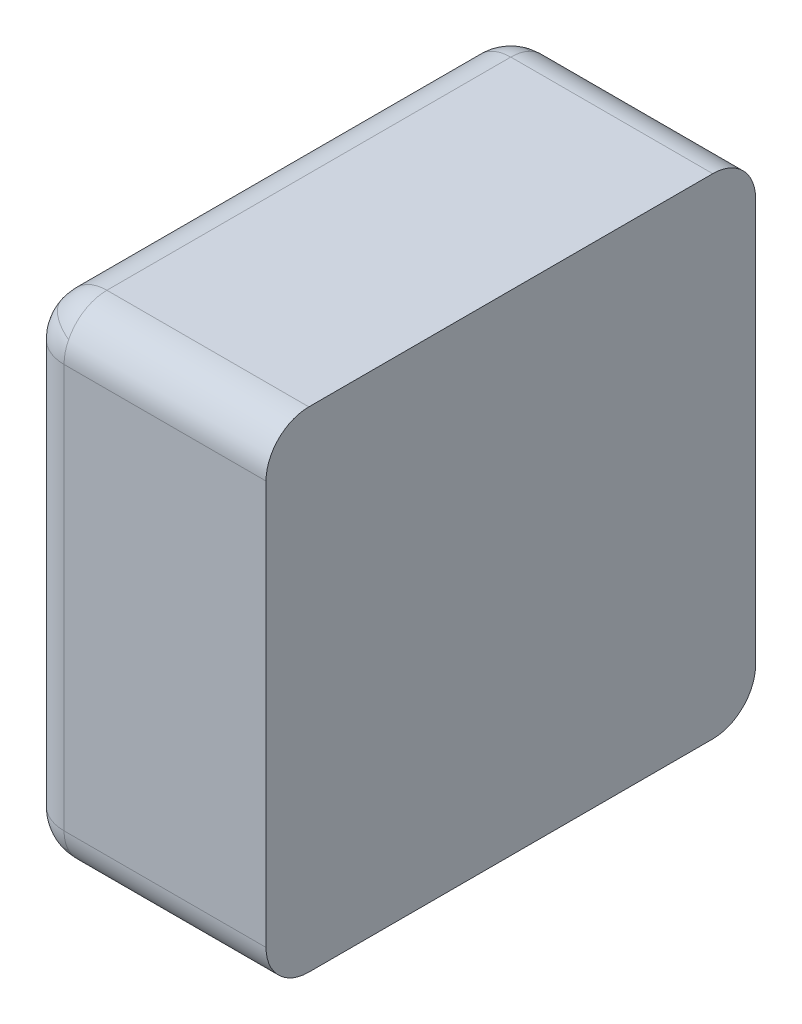
ISO-10303-21;
HEADER;
FILE_DESCRIPTION(('STEP AP214'),'2;1');
FILE_NAME('part.step','',(''),(''),'','','');
FILE_SCHEMA(('AUTOMOTIVE_DESIGN { 1 0 10303 214 1 1 1 1 }'));
ENDSEC;
DATA;
#1=APPLICATION_CONTEXT('core data for automotive mechanical design processes');
#2=APPLICATION_PROTOCOL_DEFINITION('international standard','automotive_design',2000,#1);
#3=PRODUCT_CONTEXT('',#1,'mechanical');
#4=PRODUCT('Part','Part','',(#3));
#5=PRODUCT_RELATED_PRODUCT_CATEGORY('part','',(#4));
#6=PRODUCT_DEFINITION_FORMATION('','',#4);
#7=PRODUCT_DEFINITION_CONTEXT('part definition',#1,'design');
#8=PRODUCT_DEFINITION('design','',#6,#7);
#9=PRODUCT_DEFINITION_SHAPE('','',#8);
#10=(LENGTH_UNIT() NAMED_UNIT(*) SI_UNIT(.MILLI.,.METRE.));
#11=(NAMED_UNIT(*) PLANE_ANGLE_UNIT() SI_UNIT($,.RADIAN.));
#12=(NAMED_UNIT(*) SI_UNIT($,.STERADIAN.) SOLID_ANGLE_UNIT());
#13=UNCERTAINTY_MEASURE_WITH_UNIT(LENGTH_MEASURE(1.E-05),#10,'distance_accuracy_value','');
#14=(GEOMETRIC_REPRESENTATION_CONTEXT(3) GLOBAL_UNCERTAINTY_ASSIGNED_CONTEXT((#13)) GLOBAL_UNIT_ASSIGNED_CONTEXT((#10,
#11,#12)) REPRESENTATION_CONTEXT('',''));
#15=CARTESIAN_POINT('',(0.,0.,0.));
#16=DIRECTION('',(0.,0.,1.));
#17=DIRECTION('',(1.,0.,0.));
#18=AXIS2_PLACEMENT_3D('',#15,#16,#17);
#19=CARTESIAN_POINT('',(-0.770414518843274,-0.370414518843274,0.0295854811567261));
#20=CARTESIAN_POINT('',(-0.770414518843274,-0.370414518843274,0.029585481156726));
#21=CARTESIAN_POINT('',(-0.770414518843274,-0.370414518843274,0.0295854811567259));
#22=CARTESIAN_POINT('',(-0.770414518843274,-0.370414518843274,0.0295854811567262));
#23=CARTESIAN_POINT('',(-0.786913435216178,-0.370414518843274,0.0460843975296307));
#24=CARTESIAN_POINT('',(-0.805964742834645,-0.332311903606339,0.0270330899111633));
#25=CARTESIAN_POINT('',(-0.772966910088836,-0.332311903606339,-0.00596474283464589));
#26=CARTESIAN_POINT('',(-0.753915602470369,-0.370414518843274,0.0130865647838215));
#27=CARTESIAN_POINT('',(-0.795316860626127,-0.364187485463226,0.0669418896996738));
#28=CARTESIAN_POINT('',(-0.831261966886138,-0.292297272943205,0.0309967834396627));
#29=CARTESIAN_POINT('',(-0.769003216560336,-0.292297272943205,-0.0312619668861383));
#30=CARTESIAN_POINT('',(-0.733058110300326,-0.364187485463227,0.00468313937387291));
#31=CARTESIAN_POINT('',(-0.793721464748298,-0.353143808025074,0.0874338486981503));
#32=CARTESIAN_POINT('',(-0.840576506812773,-0.259433723896123,0.040578806633675));
#33=CARTESIAN_POINT('',(-0.759421193366325,-0.259433723896124,-0.0405765068127728));
#34=CARTESIAN_POINT('',(-0.71256615130185,-0.353143808025074,0.00627853525170252));
#35=(BOUNDED_SURFACE() B_SPLINE_SURFACE(3,3,((#19,#20,#21,#22),(#23,#24,#25,#26),(#27,#28,#29,
#30),(#31,#32,#33,#34)),.UNSPECIFIED.,.F.,.F.,.F.) B_SPLINE_SURFACE_WITH_KNOTS((4,4),(4,4),(0.,
1.),(0.,1.),.UNSPECIFIED.) GEOMETRIC_REPRESENTATION_ITEM() RATIONAL_B_SPLINE_SURFACE(((1.,
0.333333333333333,0.333333333333333,1.),(0.924501806030637,0.308167268676879,0.308167268676879,
0.924501806030637),(0.924501806030637,0.308167268676879,0.308167268676879,0.924501806030637),
(1.,0.333333333333333,0.333333333333333,1.))) REPRESENTATION_ITEM('') SURFACE());
#36=CARTESIAN_POINT('',(-0.73,-0.33,0.07));
#37=DIRECTION('',(0.408248290463862,-0.816496580927726,0.408248290463864));
#38=DIRECTION('',(-0.577350269189624,-0.577350269189626,-0.577350269189627));
#39=AXIS2_PLACEMENT_3D('',#36,#37,#38);
#40=CIRCLE('',#39,0.07);
#41=CARTESIAN_POINT('',(-0.770414518843274,-0.370414518843274,0.0295854811567261));
#42=VERTEX_POINT('',#41);
#43=CARTESIAN_POINT('',(-0.73,-0.361304951684997,0.00739009663000593));
#44=VERTEX_POINT('',#43);
#45=EDGE_CURVE('E11',#42,#44,#40,.T.);
#46=CARTESIAN_POINT('',(-0.73,-0.33,0.07));
#47=DIRECTION('',(-0.408248290463862,0.816496580927726,-0.408248290463864));
#48=DIRECTION('',(-0.577350269189625,-0.577350269189626,-0.577350269189626));
#49=AXIS2_PLACEMENT_3D('',#46,#47,#48);
#50=CIRCLE('',#49,0.07);
#51=CARTESIAN_POINT('',(-0.792609903369994,-0.361304951684997,0.07));
#52=VERTEX_POINT('',#51);
#53=EDGE_CURVE('E26',#42,#52,#50,.T.);
#54=CARTESIAN_POINT('',(-0.73,-0.33,0.07));
#55=DIRECTION('',(0.,0.,-1.));
#56=DIRECTION('',(1.,0.,0.));
#57=AXIS2_PLACEMENT_3D('',#54,#55,#56);
#58=CIRCLE('',#57,0.07);
#59=CARTESIAN_POINT('',(-0.8,-0.33,0.07));
#60=VERTEX_POINT('',#59);
#61=EDGE_CURVE('E274',#52,#60,#58,.T.);
#62=CARTESIAN_POINT('',(-0.73,-0.33,0.07));
#63=DIRECTION('',(0.,1.,0.));
#64=DIRECTION('',(1.,0.,0.));
#65=AXIS2_PLACEMENT_3D('',#62,#63,#64);
#66=CIRCLE('',#65,0.07);
#67=CARTESIAN_POINT('',(-0.73,-0.33,0.));
#68=VERTEX_POINT('',#67);
#69=EDGE_CURVE('E271',#68,#60,#66,.T.);
#70=CARTESIAN_POINT('',(-0.73,-0.33,0.07));
#71=DIRECTION('',(1.,0.,0.));
#72=DIRECTION('',(0.,0.,-1.));
#73=AXIS2_PLACEMENT_3D('',#70,#71,#72);
#74=CIRCLE('',#73,0.07);
#75=EDGE_CURVE('E268',#44,#68,#74,.T.);
#76=ORIENTED_EDGE('',*,*,#45,.F.);
#77=ORIENTED_EDGE('',*,*,#53,.T.);
#78=ORIENTED_EDGE('',*,*,#61,.T.);
#79=ORIENTED_EDGE('',*,*,#69,.F.);
#80=ORIENTED_EDGE('',*,*,#75,.F.);
#81=EDGE_LOOP('',(#76,#77,#78,#79,#80));
#82=FACE_BOUND('',#81,.T.);
#83=ADVANCED_FACE('F17',(#82),#35,.T.);
#84=CARTESIAN_POINT('',(-0.770414518843274,-0.370414518843274,0.770414518843274));
#85=CARTESIAN_POINT('',(-0.770414518843273,-0.370414518843274,0.770414518843274));
#86=CARTESIAN_POINT('',(-0.770414518843274,-0.370414518843273,0.770414518843274));
#87=CARTESIAN_POINT('',(-0.770414518843274,-0.370414518843274,0.770414518843274));
#88=CARTESIAN_POINT('',(-0.753915602470369,-0.370414518843274,0.786913435216178));
#89=CARTESIAN_POINT('',(-0.772966910088836,-0.332311903606339,0.805964742834646));
#90=CARTESIAN_POINT('',(-0.805964742834646,-0.332311903606339,0.772966910088837));
#91=CARTESIAN_POINT('',(-0.786913435216179,-0.370414518843274,0.753915602470369));
#92=CARTESIAN_POINT('',(-0.733058110300326,-0.364187485463227,0.795316860626127));
#93=CARTESIAN_POINT('',(-0.769003216560336,-0.292297272943205,0.831261966886138));
#94=CARTESIAN_POINT('',(-0.831261966886138,-0.292297272943204,0.769003216560338));
#95=CARTESIAN_POINT('',(-0.795316860626127,-0.364187485463227,0.733058110300326));
#96=CARTESIAN_POINT('',(-0.712566151301849,-0.353143808025074,0.793721464748297));
#97=CARTESIAN_POINT('',(-0.759421193366324,-0.259433723896123,0.840576506812773));
#98=CARTESIAN_POINT('',(-0.840576506812773,-0.259433723896122,0.759421193366326));
#99=CARTESIAN_POINT('',(-0.793721464748298,-0.353143808025074,0.71256615130185));
#100=(BOUNDED_SURFACE() B_SPLINE_SURFACE(3,3,((#84,#85,#86,#87),(#88,#89,#90,#91),(#92,#93,#94,
#95),(#96,#97,#98,#99)),.UNSPECIFIED.,.F.,.F.,.F.) B_SPLINE_SURFACE_WITH_KNOTS((4,4),(4,4),(0.,
1.),(0.,1.),.UNSPECIFIED.) GEOMETRIC_REPRESENTATION_ITEM() RATIONAL_B_SPLINE_SURFACE(((1.,
0.333333333333332,0.333333333333332,1.),(0.924501806030637,0.308167268676878,0.308167268676878,
0.924501806030637),(0.924501806030637,0.308167268676878,0.308167268676878,0.924501806030637),
(1.,0.333333333333332,0.333333333333332,1.))) REPRESENTATION_ITEM('') SURFACE());
#101=CARTESIAN_POINT('',(-0.73,-0.33,0.73));
#102=DIRECTION('',(0.408248290463862,-0.816496580927726,-0.408248290463864));
#103=DIRECTION('',(-0.577350269189624,-0.577350269189626,0.577350269189628));
#104=AXIS2_PLACEMENT_3D('',#101,#102,#103);
#105=CIRCLE('',#104,0.07);
#106=CARTESIAN_POINT('',(-0.770414518843274,-0.370414518843274,0.770414518843274));
#107=VERTEX_POINT('',#106);
#108=CARTESIAN_POINT('',(-0.792609903369994,-0.361304951684997,0.73));
#109=VERTEX_POINT('',#108);
#110=EDGE_CURVE('E266',#107,#109,#105,.T.);
#111=CARTESIAN_POINT('',(-0.73,-0.33,0.73));
#112=DIRECTION('',(-0.408248290463862,0.816496580927726,0.408248290463864));
#113=DIRECTION('',(-0.577350269189625,-0.577350269189626,0.577350269189627));
#114=AXIS2_PLACEMENT_3D('',#111,#112,#113);
#115=CIRCLE('',#114,0.07);
#116=CARTESIAN_POINT('',(-0.73,-0.361304951684997,0.792609903369994));
#117=VERTEX_POINT('',#116);
#118=EDGE_CURVE('E264',#107,#117,#115,.T.);
#119=CARTESIAN_POINT('',(-0.73,-0.33,0.73));
#120=DIRECTION('',(1.,0.,0.));
#121=DIRECTION('',(0.,0.,-1.));
#122=AXIS2_PLACEMENT_3D('',#119,#120,#121);
#123=CIRCLE('',#122,0.07);
#124=CARTESIAN_POINT('',(-0.73,-0.33,0.8));
#125=VERTEX_POINT('',#124);
#126=EDGE_CURVE('E261',#125,#117,#123,.T.);
#127=CARTESIAN_POINT('',(-0.73,-0.33,0.73));
#128=DIRECTION('',(0.,-1.,0.));
#129=DIRECTION('',(1.,0.,0.));
#130=AXIS2_PLACEMENT_3D('',#127,#128,#129);
#131=CIRCLE('',#130,0.07);
#132=CARTESIAN_POINT('',(-0.8,-0.33,0.73));
#133=VERTEX_POINT('',#132);
#134=EDGE_CURVE('E259',#125,#133,#131,.T.);
#135=CARTESIAN_POINT('',(-0.73,-0.33,0.73));
#136=DIRECTION('',(0.,0.,-1.));
#137=DIRECTION('',(1.,0.,0.));
#138=AXIS2_PLACEMENT_3D('',#135,#136,#137);
#139=CIRCLE('',#138,0.07);
#140=EDGE_CURVE('E256',#109,#133,#139,.T.);
#141=ORIENTED_EDGE('',*,*,#110,.F.);
#142=ORIENTED_EDGE('',*,*,#118,.T.);
#143=ORIENTED_EDGE('',*,*,#126,.F.);
#144=ORIENTED_EDGE('',*,*,#134,.T.);
#145=ORIENTED_EDGE('',*,*,#140,.F.);
#146=EDGE_LOOP('',(#141,#142,#143,#144,#145));
#147=FACE_BOUND('',#146,.T.);
#148=ADVANCED_FACE('F298',(#147),#100,.T.);
#149=CARTESIAN_POINT('',(-0.770414518843274,0.370414518843274,0.770414518843274));
#150=CARTESIAN_POINT('',(-0.770414518843274,0.370414518843274,0.770414518843274));
#151=CARTESIAN_POINT('',(-0.770414518843275,0.370414518843274,0.770414518843274));
#152=CARTESIAN_POINT('',(-0.770414518843274,0.370414518843274,0.770414518843274));
#153=CARTESIAN_POINT('',(-0.753915602470369,0.370414518843274,0.786913435216179));
#154=CARTESIAN_POINT('',(-0.734864294851902,0.408517134080209,0.767862127597712));
#155=CARTESIAN_POINT('',(-0.767862127597712,0.408517134080209,0.734864294851902));
#156=CARTESIAN_POINT('',(-0.786913435216179,0.370414518843274,0.753915602470369));
#157=CARTESIAN_POINT('',(-0.733058110300326,0.364187485463227,0.795316860626128));
#158=CARTESIAN_POINT('',(-0.697113004040315,0.436077697983249,0.759371754366117));
#159=CARTESIAN_POINT('',(-0.759371754366117,0.436077697983249,0.697113004040315));
#160=CARTESIAN_POINT('',(-0.795316860626128,0.364187485463226,0.733058110300326));
#161=CARTESIAN_POINT('',(-0.712566151301849,0.353143808025074,0.793721464748298));
#162=CARTESIAN_POINT('',(-0.665711109237374,0.446853892154025,0.746866422683823));
#163=CARTESIAN_POINT('',(-0.746866422683823,0.446853892154025,0.665711109237374));
#164=CARTESIAN_POINT('',(-0.793721464748298,0.353143808025074,0.712566151301849));
#165=(BOUNDED_SURFACE() B_SPLINE_SURFACE(3,3,((#149,#150,#151,#152),(#153,#154,#155,#156),(#157,
#158,#159,#160),(#161,#162,#163,#164)),.UNSPECIFIED.,.F.,.F.,
.F.) B_SPLINE_SURFACE_WITH_KNOTS((4,4),(4,4),(0.,1.),(0.,1.),
.UNSPECIFIED.) GEOMETRIC_REPRESENTATION_ITEM() RATIONAL_B_SPLINE_SURFACE(((1.,0.333333333333333,
0.333333333333333,1.),(0.924501806030636,0.308167268676879,0.308167268676879,0.924501806030636),
(0.924501806030636,0.308167268676879,0.308167268676879,0.924501806030636),(1.,0.333333333333333,
0.333333333333333,1.))) REPRESENTATION_ITEM('') SURFACE());
#166=CARTESIAN_POINT('',(-0.73,0.33,0.73));
#167=DIRECTION('',(-0.408248290463862,-0.816496580927727,0.408248290463862));
#168=DIRECTION('',(-0.577350269189627,0.577350269189624,0.577350269189627));
#169=AXIS2_PLACEMENT_3D('',#166,#167,#168);
#170=CIRCLE('',#169,0.07);
#171=CARTESIAN_POINT('',(-0.770414518843274,0.370414518843274,0.770414518843274));
#172=VERTEX_POINT('',#171);
#173=CARTESIAN_POINT('',(-0.792609903369994,0.361304951684997,0.73));
#174=VERTEX_POINT('',#173);
#175=EDGE_CURVE('E153',#172,#174,#170,.T.);
#176=CARTESIAN_POINT('',(-0.73,0.33,0.73));
#177=DIRECTION('',(0.408248290463861,0.816496580927728,-0.408248290463861));
#178=DIRECTION('',(-0.577350269189627,0.577350269189623,0.577350269189627));
#179=AXIS2_PLACEMENT_3D('',#176,#177,#178);
#180=CIRCLE('',#179,0.0700000000000001);
#181=CARTESIAN_POINT('',(-0.73,0.361304951684997,0.792609903369994));
#182=VERTEX_POINT('',#181);
#183=EDGE_CURVE('E253',#172,#182,#180,.T.);
#184=CARTESIAN_POINT('',(-0.73,0.33,0.73));
#185=DIRECTION('',(1.,0.,0.));
#186=DIRECTION('',(0.,-1.,0.));
#187=AXIS2_PLACEMENT_3D('',#184,#185,#186);
#188=CIRCLE('',#187,0.07);
#189=CARTESIAN_POINT('',(-0.73,0.4,0.73));
#190=VERTEX_POINT('',#189);
#191=EDGE_CURVE('E250',#190,#182,#188,.T.);
#192=CARTESIAN_POINT('',(-0.73,0.33,0.73));
#193=DIRECTION('',(0.,0.,1.));
#194=DIRECTION('',(1.,0.,0.));
#195=AXIS2_PLACEMENT_3D('',#192,#193,#194);
#196=CIRCLE('',#195,0.07);
#197=EDGE_CURVE('E248',#190,#174,#196,.T.);
#198=ORIENTED_EDGE('',*,*,#175,.F.);
#199=ORIENTED_EDGE('',*,*,#183,.T.);
#200=ORIENTED_EDGE('',*,*,#191,.F.);
#201=ORIENTED_EDGE('',*,*,#197,.T.);
#202=EDGE_LOOP('',(#198,#199,#200,#201));
#203=FACE_BOUND('',#202,.T.);
#204=ADVANCED_FACE('F309',(#203),#165,.T.);
#205=CARTESIAN_POINT('',(-0.770414518843274,0.370414518843274,0.0295854811567261));
#206=CARTESIAN_POINT('',(-0.770414518843274,0.370414518843274,0.0295854811567261));
#207=CARTESIAN_POINT('',(-0.770414518843274,0.370414518843274,0.0295854811567262));
#208=CARTESIAN_POINT('',(-0.770414518843274,0.370414518843274,0.0295854811567262));
#209=CARTESIAN_POINT('',(-0.786913435216178,0.353915602470369,0.0295854811567261));
#210=CARTESIAN_POINT('',(-0.805964742834646,0.372966910088836,0.0676880963936605));
#211=CARTESIAN_POINT('',(-0.772966910088837,0.405964742834646,0.0676880963936607));
#212=CARTESIAN_POINT('',(-0.753915602470369,0.386913435216178,0.0295854811567262));
#213=CARTESIAN_POINT('',(-0.795316860626127,0.333058110300326,0.0358125145367733));
#214=CARTESIAN_POINT('',(-0.831261966886138,0.369003216560336,0.107702727056795));
#215=CARTESIAN_POINT('',(-0.769003216560337,0.431261966886138,0.107702727056795));
#216=CARTESIAN_POINT('',(-0.733058110300326,0.395316860626127,0.0358125145367735));
#217=CARTESIAN_POINT('',(-0.793721464748297,0.31256615130185,0.0468561919749262));
#218=CARTESIAN_POINT('',(-0.840576506812773,0.359421193366325,0.140566276103877));
#219=CARTESIAN_POINT('',(-0.759421193366325,0.440576506812772,0.140566276103877));
#220=CARTESIAN_POINT('',(-0.71256615130185,0.393721464748297,0.0468561919749265));
#221=(BOUNDED_SURFACE() B_SPLINE_SURFACE(3,3,((#205,#206,#207,#208),(#209,#210,#211,#212),(#213,
#214,#215,#216),(#217,#218,#219,#220)),.UNSPECIFIED.,.F.,.F.,
.F.) B_SPLINE_SURFACE_WITH_KNOTS((4,4),(4,4),(0.,1.),(0.,1.),
.UNSPECIFIED.) GEOMETRIC_REPRESENTATION_ITEM() RATIONAL_B_SPLINE_SURFACE(((1.,0.333333333333332,
0.333333333333332,1.),(0.924501806030637,0.308167268676878,0.308167268676878,0.924501806030637),
(0.924501806030637,0.308167268676878,0.308167268676878,0.924501806030637),(1.,0.333333333333332,
0.333333333333332,1.))) REPRESENTATION_ITEM('') SURFACE());
#222=CARTESIAN_POINT('',(-0.73,0.33,0.07));
#223=DIRECTION('',(0.408248290463864,-0.408248290463862,-0.816496580927726));
#224=DIRECTION('',(-0.577350269189628,0.577350269189624,-0.577350269189626));
#225=AXIS2_PLACEMENT_3D('',#222,#223,#224);
#226=CIRCLE('',#225,0.07);
#227=CARTESIAN_POINT('',(-0.770414518843274,0.370414518843273,0.0295854811567262));
#228=VERTEX_POINT('',#227);
#229=CARTESIAN_POINT('',(-0.73,0.392609903369994,0.038695048315003));
#230=VERTEX_POINT('',#229);
#231=EDGE_CURVE('E246',#228,#230,#226,.T.);
#232=CARTESIAN_POINT('',(-0.73,0.33,0.0699999999999999));
#233=DIRECTION('',(-0.408248290463865,0.408248290463862,0.816496580927726));
#234=DIRECTION('',(-0.577350269189627,0.577350269189624,-0.577350269189627));
#235=AXIS2_PLACEMENT_3D('',#232,#233,#234);
#236=CIRCLE('',#235,0.0699999999999999);
#237=CARTESIAN_POINT('',(-0.792609903369994,0.33,0.0386950483150028));
#238=VERTEX_POINT('',#237);
#239=EDGE_CURVE('E244',#228,#238,#236,.T.);
#240=CARTESIAN_POINT('',(-0.73,0.33,0.07));
#241=DIRECTION('',(0.,-1.,0.));
#242=DIRECTION('',(1.,0.,0.));
#243=AXIS2_PLACEMENT_3D('',#240,#241,#242);
#244=CIRCLE('',#243,0.07);
#245=CARTESIAN_POINT('',(-0.8,0.33,0.07));
#246=VERTEX_POINT('',#245);
#247=EDGE_CURVE('E241',#246,#238,#244,.T.);
#248=CARTESIAN_POINT('',(-0.73,0.33,0.07));
#249=DIRECTION('',(0.,0.,1.));
#250=DIRECTION('',(1.,0.,0.));
#251=AXIS2_PLACEMENT_3D('',#248,#249,#250);
#252=CIRCLE('',#251,0.07);
#253=CARTESIAN_POINT('',(-0.73,0.4,0.07));
#254=VERTEX_POINT('',#253);
#255=EDGE_CURVE('E161',#254,#246,#252,.T.);
#256=CARTESIAN_POINT('',(-0.73,0.33,0.07));
#257=DIRECTION('',(1.,0.,0.));
#258=DIRECTION('',(0.,-1.,0.));
#259=AXIS2_PLACEMENT_3D('',#256,#257,#258);
#260=CIRCLE('',#259,0.07);
#261=EDGE_CURVE('E237',#230,#254,#260,.T.);
#262=ORIENTED_EDGE('',*,*,#231,.F.);
#263=ORIENTED_EDGE('',*,*,#239,.T.);
#264=ORIENTED_EDGE('',*,*,#247,.F.);
#265=ORIENTED_EDGE('',*,*,#255,.F.);
#266=ORIENTED_EDGE('',*,*,#261,.F.);
#267=EDGE_LOOP('',(#262,#263,#264,#265,#266));
#268=FACE_BOUND('',#267,.T.);
#269=ADVANCED_FACE('F321',(#268),#221,.T.);
#270=CARTESIAN_POINT('',(-0.4,-0.4,0.));
#271=DIRECTION('',(1.,0.,0.));
#272=DIRECTION('',(0.,0.,-1.));
#273=AXIS2_PLACEMENT_3D('',#270,#271,#272);
#274=PLANE('',#273);
#275=CARTESIAN_POINT('',(-0.4,-0.33,0.07));
#276=DIRECTION('',(1.,0.,0.));
#277=DIRECTION('',(0.,0.,-1.));
#278=AXIS2_PLACEMENT_3D('',#275,#276,#277);
#279=CIRCLE('',#278,0.07);
#280=CARTESIAN_POINT('',(-0.4,-0.4,0.07));
#281=VERTEX_POINT('',#280);
#282=CARTESIAN_POINT('',(-0.4,-0.33,0.));
#283=VERTEX_POINT('',#282);
#284=EDGE_CURVE('E235',#281,#283,#279,.T.);
#285=ORIENTED_EDGE('',*,*,#284,.T.);
#286=DIRECTION('',(0.,1.,0.));
#287=VECTOR('',#286,1.);
#288=CARTESIAN_POINT('',(-0.4,-0.4,0.));
#289=LINE('',#288,#287);
#290=CARTESIAN_POINT('',(-0.4,0.33,0.));
#291=VERTEX_POINT('',#290);
#292=EDGE_CURVE('E233',#283,#291,#289,.T.);
#293=ORIENTED_EDGE('',*,*,#292,.T.);
#294=CARTESIAN_POINT('',(-0.4,0.33,0.07));
#295=DIRECTION('',(1.,0.,0.));
#296=DIRECTION('',(0.,-1.,0.));
#297=AXIS2_PLACEMENT_3D('',#294,#295,#296);
#298=CIRCLE('',#297,0.07);
#299=CARTESIAN_POINT('',(-0.4,0.4,0.07));
#300=VERTEX_POINT('',#299);
#301=EDGE_CURVE('E231',#291,#300,#298,.T.);
#302=ORIENTED_EDGE('',*,*,#301,.T.);
#303=DIRECTION('',(0.,0.,1.));
#304=VECTOR('',#303,1.);
#305=CARTESIAN_POINT('',(-0.4,0.4,0.));
#306=LINE('',#305,#304);
#307=CARTESIAN_POINT('',(-0.4,0.4,0.73));
#308=VERTEX_POINT('',#307);
#309=EDGE_CURVE('E229',#300,#308,#306,.T.);
#310=ORIENTED_EDGE('',*,*,#309,.T.);
#311=CARTESIAN_POINT('',(-0.4,0.33,0.73));
#312=DIRECTION('',(1.,0.,0.));
#313=DIRECTION('',(0.,-1.,0.));
#314=AXIS2_PLACEMENT_3D('',#311,#312,#313);
#315=CIRCLE('',#314,0.07);
#316=CARTESIAN_POINT('',(-0.4,0.33,0.8));
#317=VERTEX_POINT('',#316);
#318=EDGE_CURVE('E227',#308,#317,#315,.T.);
#319=ORIENTED_EDGE('',*,*,#318,.T.);
#320=DIRECTION('',(0.,-1.,0.));
#321=VECTOR('',#320,1.);
#322=CARTESIAN_POINT('',(-0.4,-0.4,0.8));
#323=LINE('',#322,#321);
#324=CARTESIAN_POINT('',(-0.4,-0.33,0.8));
#325=VERTEX_POINT('',#324);
#326=EDGE_CURVE('E225',#317,#325,#323,.T.);
#327=ORIENTED_EDGE('',*,*,#326,.T.);
#328=CARTESIAN_POINT('',(-0.4,-0.33,0.73));
#329=DIRECTION('',(1.,0.,0.));
#330=DIRECTION('',(0.,0.,-1.));
#331=AXIS2_PLACEMENT_3D('',#328,#329,#330);
#332=CIRCLE('',#331,0.07);
#333=CARTESIAN_POINT('',(-0.4,-0.4,0.73));
#334=VERTEX_POINT('',#333);
#335=EDGE_CURVE('E223',#325,#334,#332,.T.);
#336=ORIENTED_EDGE('',*,*,#335,.T.);
#337=DIRECTION('',(0.,0.,-1.));
#338=VECTOR('',#337,1.);
#339=CARTESIAN_POINT('',(-0.4,-0.4,0.));
#340=LINE('',#339,#338);
#341=EDGE_CURVE('E220',#334,#281,#340,.T.);
#342=ORIENTED_EDGE('',*,*,#341,.T.);
#343=EDGE_LOOP('',(#285,#293,#302,#310,#319,#327,#336,#342));
#344=FACE_BOUND('',#343,.T.);
#345=ADVANCED_FACE('F366',(#344),#274,.T.);
#346=CARTESIAN_POINT('',(-0.6,0.,0.));
#347=DIRECTION('',(0.,0.,1.));
#348=DIRECTION('',(1.,0.,0.));
#349=AXIS2_PLACEMENT_3D('',#346,#347,#348);
#350=PLANE('',#349);
#351=ORIENTED_EDGE('',*,*,#292,.F.);
#352=DIRECTION('',(1.,0.,0.));
#353=VECTOR('',#352,1.);
#354=CARTESIAN_POINT('',(-0.6,-0.33,0.));
#355=LINE('',#354,#353);
#356=EDGE_CURVE('E217',#68,#283,#355,.T.);
#357=ORIENTED_EDGE('',*,*,#356,.F.);
#358=DIRECTION('',(0.,-1.,0.));
#359=VECTOR('',#358,1.);
#360=CARTESIAN_POINT('',(-0.73,0.,0.));
#361=LINE('',#360,#359);
#362=CARTESIAN_POINT('',(-0.73,0.33,0.));
#363=VERTEX_POINT('',#362);
#364=EDGE_CURVE('E214',#363,#68,#361,.T.);
#365=ORIENTED_EDGE('',*,*,#364,.F.);
#366=DIRECTION('',(-1.,0.,0.));
#367=VECTOR('',#366,1.);
#368=CARTESIAN_POINT('',(-0.6,0.33,0.));
#369=LINE('',#368,#367);
#370=EDGE_CURVE('E211',#291,#363,#369,.T.);
#371=ORIENTED_EDGE('',*,*,#370,.F.);
#372=EDGE_LOOP('',(#351,#357,#365,#371));
#373=FACE_BOUND('',#372,.T.);
#374=ADVANCED_FACE('F374',(#373),#350,.F.);
#375=CARTESIAN_POINT('',(-0.7,-0.33,0.07));
#376=DIRECTION('',(1.,0.,0.));
#377=DIRECTION('',(0.,0.,-1.));
#378=AXIS2_PLACEMENT_3D('',#375,#376,#377);
#379=CYLINDRICAL_SURFACE('',#378,0.07);
#380=CARTESIAN_POINT('',(-0.73,-0.33,0.07));
#381=DIRECTION('',(1.,0.,0.));
#382=DIRECTION('',(0.,0.,-1.));
#383=AXIS2_PLACEMENT_3D('',#380,#381,#382);
#384=CIRCLE('',#383,0.07);
#385=CARTESIAN_POINT('',(-0.73,-0.4,0.07));
#386=VERTEX_POINT('',#385);
#387=EDGE_CURVE('E208',#386,#44,#384,.T.);
#388=ORIENTED_EDGE('',*,*,#387,.T.);
#389=ORIENTED_EDGE('',*,*,#75,.T.);
#390=ORIENTED_EDGE('',*,*,#356,.T.);
#391=ORIENTED_EDGE('',*,*,#284,.F.);
#392=DIRECTION('',(-1.,0.,0.));
#393=VECTOR('',#392,1.);
#394=CARTESIAN_POINT('',(-0.7,-0.4,0.07));
#395=LINE('',#394,#393);
#396=EDGE_CURVE('E205',#281,#386,#395,.T.);
#397=ORIENTED_EDGE('',*,*,#396,.T.);
#398=EDGE_LOOP('',(#388,#389,#390,#391,#397));
#399=FACE_BOUND('',#398,.T.);
#400=ADVANCED_FACE('F283',(#399),#379,.T.);
#401=CARTESIAN_POINT('',(-0.8,-0.4,0.));
#402=DIRECTION('',(0.,-1.,0.));
#403=DIRECTION('',(0.,0.,-1.));
#404=AXIS2_PLACEMENT_3D('',#401,#402,#403);
#405=PLANE('',#404);
#406=DIRECTION('',(-1.,0.,0.));
#407=VECTOR('',#406,1.);
#408=CARTESIAN_POINT('',(-0.8,-0.4,0.73));
#409=LINE('',#408,#407);
#410=CARTESIAN_POINT('',(-0.73,-0.4,0.73));
#411=VERTEX_POINT('',#410);
#412=EDGE_CURVE('E203',#334,#411,#409,.T.);
#413=ORIENTED_EDGE('',*,*,#412,.T.);
#414=DIRECTION('',(0.,0.,-1.));
#415=VECTOR('',#414,1.);
#416=CARTESIAN_POINT('',(-0.73,-0.4,0.));
#417=LINE('',#416,#415);
#418=EDGE_CURVE('E200',#411,#386,#417,.T.);
#419=ORIENTED_EDGE('',*,*,#418,.T.);
#420=ORIENTED_EDGE('',*,*,#396,.F.);
#421=ORIENTED_EDGE('',*,*,#341,.F.);
#422=EDGE_LOOP('',(#413,#419,#420,#421));
#423=FACE_BOUND('',#422,.T.);
#424=ADVANCED_FACE('F286',(#423),#405,.T.);
#425=CARTESIAN_POINT('',(-0.7,-0.33,0.73));
#426=DIRECTION('',(1.,0.,0.));
#427=DIRECTION('',(0.,0.,-1.));
#428=AXIS2_PLACEMENT_3D('',#425,#426,#427);
#429=CYLINDRICAL_SURFACE('',#428,0.07);
#430=ORIENTED_EDGE('',*,*,#126,.T.);
#431=CARTESIAN_POINT('',(-0.73,-0.33,0.73));
#432=DIRECTION('',(1.,0.,0.));
#433=DIRECTION('',(0.,0.,-1.));
#434=AXIS2_PLACEMENT_3D('',#431,#432,#433);
#435=CIRCLE('',#434,0.07);
#436=EDGE_CURVE('E197',#117,#411,#435,.T.);
#437=ORIENTED_EDGE('',*,*,#436,.T.);
#438=ORIENTED_EDGE('',*,*,#412,.F.);
#439=ORIENTED_EDGE('',*,*,#335,.F.);
#440=DIRECTION('',(-1.,0.,0.));
#441=VECTOR('',#440,1.);
#442=CARTESIAN_POINT('',(-0.7,-0.33,0.8));
#443=LINE('',#442,#441);
#444=EDGE_CURVE('E194',#325,#125,#443,.T.);
#445=ORIENTED_EDGE('',*,*,#444,.T.);
#446=EDGE_LOOP('',(#430,#437,#438,#439,#445));
#447=FACE_BOUND('',#446,.T.);
#448=ADVANCED_FACE('F291',(#447),#429,.T.);
#449=CARTESIAN_POINT('',(-0.6,0.,0.8));
#450=DIRECTION('',(0.,0.,1.));
#451=DIRECTION('',(1.,0.,0.));
#452=AXIS2_PLACEMENT_3D('',#449,#450,#451);
#453=PLANE('',#452);
#454=ORIENTED_EDGE('',*,*,#444,.F.);
#455=ORIENTED_EDGE('',*,*,#326,.F.);
#456=DIRECTION('',(-1.,0.,0.));
#457=VECTOR('',#456,1.);
#458=CARTESIAN_POINT('',(-0.6,0.33,0.8));
#459=LINE('',#458,#457);
#460=CARTESIAN_POINT('',(-0.73,0.33,0.8));
#461=VERTEX_POINT('',#460);
#462=EDGE_CURVE('E192',#317,#461,#459,.T.);
#463=ORIENTED_EDGE('',*,*,#462,.T.);
#464=DIRECTION('',(0.,-1.,0.));
#465=VECTOR('',#464,1.);
#466=CARTESIAN_POINT('',(-0.73,0.,0.8));
#467=LINE('',#466,#465);
#468=EDGE_CURVE('E133',#461,#125,#467,.T.);
#469=ORIENTED_EDGE('',*,*,#468,.T.);
#470=EDGE_LOOP('',(#454,#455,#463,#469));
#471=FACE_BOUND('',#470,.T.);
#472=ADVANCED_FACE('F302',(#471),#453,.T.);
#473=CARTESIAN_POINT('',(-0.5,0.33,0.73));
#474=DIRECTION('',(-1.,0.,0.));
#475=DIRECTION('',(0.,-1.,0.));
#476=AXIS2_PLACEMENT_3D('',#473,#474,#475);
#477=CYLINDRICAL_SURFACE('',#476,0.07);
#478=ORIENTED_EDGE('',*,*,#191,.T.);
#479=CARTESIAN_POINT('',(-0.73,0.33,0.73));
#480=DIRECTION('',(1.,0.,0.));
#481=DIRECTION('',(0.,-1.,0.));
#482=AXIS2_PLACEMENT_3D('',#479,#480,#481);
#483=CIRCLE('',#482,0.07);
#484=EDGE_CURVE('E189',#182,#461,#483,.T.);
#485=ORIENTED_EDGE('',*,*,#484,.T.);
#486=ORIENTED_EDGE('',*,*,#462,.F.);
#487=ORIENTED_EDGE('',*,*,#318,.F.);
#488=DIRECTION('',(-1.,0.,0.));
#489=VECTOR('',#488,1.);
#490=CARTESIAN_POINT('',(-0.5,0.4,0.73));
#491=LINE('',#490,#489);
#492=EDGE_CURVE('E186',#308,#190,#491,.T.);
#493=ORIENTED_EDGE('',*,*,#492,.T.);
#494=EDGE_LOOP('',(#478,#485,#486,#487,#493));
#495=FACE_BOUND('',#494,.T.);
#496=ADVANCED_FACE('F306',(#495),#477,.T.);
#497=CARTESIAN_POINT('',(-0.4,0.4,0.));
#498=DIRECTION('',(0.,1.,0.));
#499=DIRECTION('',(-1.,0.,0.));
#500=AXIS2_PLACEMENT_3D('',#497,#498,#499);
#501=PLANE('',#500);
#502=ORIENTED_EDGE('',*,*,#492,.F.);
#503=ORIENTED_EDGE('',*,*,#309,.F.);
#504=DIRECTION('',(-1.,0.,0.));
#505=VECTOR('',#504,1.);
#506=CARTESIAN_POINT('',(-0.4,0.4,0.07));
#507=LINE('',#506,#505);
#508=EDGE_CURVE('E183',#300,#254,#507,.T.);
#509=ORIENTED_EDGE('',*,*,#508,.T.);
#510=DIRECTION('',(0.,0.,1.));
#511=VECTOR('',#510,1.);
#512=CARTESIAN_POINT('',(-0.73,0.4,0.));
#513=LINE('',#512,#511);
#514=EDGE_CURVE('E180',#254,#190,#513,.T.);
#515=ORIENTED_EDGE('',*,*,#514,.T.);
#516=EDGE_LOOP('',(#502,#503,#509,#515));
#517=FACE_BOUND('',#516,.T.);
#518=ADVANCED_FACE('F312',(#517),#501,.T.);
#519=CARTESIAN_POINT('',(-0.5,0.33,0.07));
#520=DIRECTION('',(-1.,0.,0.));
#521=DIRECTION('',(0.,-1.,0.));
#522=AXIS2_PLACEMENT_3D('',#519,#520,#521);
#523=CYLINDRICAL_SURFACE('',#522,0.07);
#524=CARTESIAN_POINT('',(-0.73,0.33,0.07));
#525=DIRECTION('',(1.,0.,0.));
#526=DIRECTION('',(0.,-1.,0.));
#527=AXIS2_PLACEMENT_3D('',#524,#525,#526);
#528=CIRCLE('',#527,0.07);
#529=EDGE_CURVE('E177',#363,#230,#528,.T.);
#530=ORIENTED_EDGE('',*,*,#529,.T.);
#531=ORIENTED_EDGE('',*,*,#261,.T.);
#532=ORIENTED_EDGE('',*,*,#508,.F.);
#533=ORIENTED_EDGE('',*,*,#301,.F.);
#534=ORIENTED_EDGE('',*,*,#370,.T.);
#535=EDGE_LOOP('',(#530,#531,#532,#533,#534));
#536=FACE_BOUND('',#535,.T.);
#537=ADVANCED_FACE('F316',(#536),#523,.T.);
#538=CARTESIAN_POINT('',(-0.73,0.2,0.07));
#539=DIRECTION('',(0.,-1.,0.));
#540=DIRECTION('',(1.,0.,0.));
#541=AXIS2_PLACEMENT_3D('',#538,#539,#540);
#542=CYLINDRICAL_SURFACE('',#541,0.07);
#543=ORIENTED_EDGE('',*,*,#247,.T.);
#544=CARTESIAN_POINT('',(-0.73,0.33,0.07));
#545=DIRECTION('',(0.,-1.,0.));
#546=DIRECTION('',(1.,0.,0.));
#547=AXIS2_PLACEMENT_3D('',#544,#545,#546);
#548=CIRCLE('',#547,0.07);
#549=EDGE_CURVE('E174',#238,#363,#548,.T.);
#550=ORIENTED_EDGE('',*,*,#549,.T.);
#551=ORIENTED_EDGE('',*,*,#364,.T.);
#552=ORIENTED_EDGE('',*,*,#69,.T.);
#553=DIRECTION('',(0.,1.,0.));
#554=VECTOR('',#553,1.);
#555=CARTESIAN_POINT('',(-0.8,0.2,0.07));
#556=LINE('',#555,#554);
#557=EDGE_CURVE('E172',#60,#246,#556,.T.);
#558=ORIENTED_EDGE('',*,*,#557,.T.);
#559=EDGE_LOOP('',(#543,#550,#551,#552,#558));
#560=FACE_BOUND('',#559,.T.);
#561=ADVANCED_FACE('F325',(#560),#542,.T.);
#562=CARTESIAN_POINT('',(-0.770414518843274,-0.370414518843274,0.0295854811567261));
#563=CARTESIAN_POINT('',(-0.770414518843274,-0.370414518843274,0.0295854811567261));
#564=CARTESIAN_POINT('',(-0.770414518843274,-0.370414518843274,0.0295854811567262));
#565=CARTESIAN_POINT('',(-0.770414518843274,-0.370414518843274,0.0295854811567262));
#566=CARTESIAN_POINT('',(-0.753915602470369,-0.370414518843274,0.0130865647838215));
#567=CARTESIAN_POINT('',(-0.734864294851902,-0.408517134080208,0.0321378724022888));
#568=CARTESIAN_POINT('',(-0.767862127597711,-0.408517134080209,0.0651357051480981));
#569=CARTESIAN_POINT('',(-0.786913435216179,-0.370414518843274,0.0460843975296307));
#570=CARTESIAN_POINT('',(-0.733058110300326,-0.364187485463227,0.00468313937387295));
#571=CARTESIAN_POINT('',(-0.697113004040315,-0.436077697983249,0.0406282456338841));
#572=CARTESIAN_POINT('',(-0.759371754366116,-0.436077697983248,0.102886995959685));
#573=CARTESIAN_POINT('',(-0.795316860626127,-0.364187485463226,0.0669418896996736));
#574=CARTESIAN_POINT('',(-0.71256615130185,-0.353143808025074,0.0062785352517024));
#575=CARTESIAN_POINT('',(-0.665711109237375,-0.446853892154024,0.0531335773161777));
#576=CARTESIAN_POINT('',(-0.746866422683823,-0.446853892154024,0.134288890762625));
#577=CARTESIAN_POINT('',(-0.793721464748298,-0.353143808025074,0.0874338486981501));
#578=(BOUNDED_SURFACE() B_SPLINE_SURFACE(3,3,((#562,#563,#564,#565),(#566,#567,#568,#569),(#570,
#571,#572,#573),(#574,#575,#576,#577)),.UNSPECIFIED.,.F.,.F.,
.F.) B_SPLINE_SURFACE_WITH_KNOTS((4,4),(4,4),(0.,1.),(0.,1.),
.UNSPECIFIED.) GEOMETRIC_REPRESENTATION_ITEM() RATIONAL_B_SPLINE_SURFACE(((1.,0.333333333333333,
0.333333333333333,1.),(0.924501806030638,0.308167268676879,0.308167268676879,0.924501806030638),
(0.924501806030638,0.308167268676879,0.308167268676879,0.924501806030638),(1.,0.333333333333333,
0.333333333333333,1.))) REPRESENTATION_ITEM('') SURFACE());
#579=CARTESIAN_POINT('',(-0.73,-0.33,0.07));
#580=DIRECTION('',(0.,0.,-1.));
#581=DIRECTION('',(1.,0.,0.));
#582=AXIS2_PLACEMENT_3D('',#579,#580,#581);
#583=CIRCLE('',#582,0.07);
#584=EDGE_CURVE('E169',#386,#52,#583,.T.);
#585=ORIENTED_EDGE('',*,*,#53,.F.);
#586=ORIENTED_EDGE('',*,*,#45,.T.);
#587=ORIENTED_EDGE('',*,*,#387,.F.);
#588=ORIENTED_EDGE('',*,*,#584,.T.);
#589=EDGE_LOOP('',(#585,#586,#587,#588));
#590=FACE_BOUND('',#589,.T.);
#591=ADVANCED_FACE('F280',(#590),#578,.T.);
#592=CARTESIAN_POINT('',(-0.73,-0.33,0.));
#593=DIRECTION('',(0.,0.,1.));
#594=DIRECTION('',(1.,0.,0.));
#595=AXIS2_PLACEMENT_3D('',#592,#593,#594);
#596=CYLINDRICAL_SURFACE('',#595,0.07);
#597=ORIENTED_EDGE('',*,*,#584,.F.);
#598=ORIENTED_EDGE('',*,*,#418,.F.);
#599=CARTESIAN_POINT('',(-0.73,-0.33,0.73));
#600=DIRECTION('',(0.,0.,-1.));
#601=DIRECTION('',(1.,0.,0.));
#602=AXIS2_PLACEMENT_3D('',#599,#600,#601);
#603=CIRCLE('',#602,0.07);
#604=EDGE_CURVE('E166',#411,#109,#603,.T.);
#605=ORIENTED_EDGE('',*,*,#604,.T.);
#606=ORIENTED_EDGE('',*,*,#140,.T.);
#607=DIRECTION('',(0.,0.,-1.));
#608=VECTOR('',#607,1.);
#609=CARTESIAN_POINT('',(-0.8,-0.33,0.));
#610=LINE('',#609,#608);
#611=EDGE_CURVE('E138',#133,#60,#610,.T.);
#612=ORIENTED_EDGE('',*,*,#611,.T.);
#613=ORIENTED_EDGE('',*,*,#61,.F.);
#614=EDGE_LOOP('',(#597,#598,#605,#606,#612,#613));
#615=FACE_BOUND('',#614,.T.);
#616=ADVANCED_FACE('F278',(#615),#596,.T.);
#617=CARTESIAN_POINT('',(-0.770414518843274,-0.370414518843274,0.770414518843274));
#618=CARTESIAN_POINT('',(-0.770414518843274,-0.370414518843274,0.770414518843274));
#619=CARTESIAN_POINT('',(-0.770414518843274,-0.370414518843274,0.770414518843274));
#620=CARTESIAN_POINT('',(-0.770414518843274,-0.370414518843274,0.770414518843274));
#621=CARTESIAN_POINT('',(-0.786913435216178,-0.370414518843274,0.75391560247037));
#622=CARTESIAN_POINT('',(-0.767862127597711,-0.408517134080208,0.734864294851902));
#623=CARTESIAN_POINT('',(-0.734864294851903,-0.408517134080208,0.767862127597711));
#624=CARTESIAN_POINT('',(-0.753915602470369,-0.370414518843274,0.786913435216178));
#625=CARTESIAN_POINT('',(-0.795316860626127,-0.364187485463226,0.733058110300326));
#626=CARTESIAN_POINT('',(-0.759371754366116,-0.436077697983249,0.697113004040315));
#627=CARTESIAN_POINT('',(-0.697113004040316,-0.436077697983248,0.759371754366116));
#628=CARTESIAN_POINT('',(-0.733058110300326,-0.364187485463227,0.795316860626127));
#629=CARTESIAN_POINT('',(-0.793721464748298,-0.353143808025074,0.71256615130185));
#630=CARTESIAN_POINT('',(-0.746866422683823,-0.446853892154024,0.665711109237375));
#631=CARTESIAN_POINT('',(-0.665711109237375,-0.446853892154024,0.746866422683822));
#632=CARTESIAN_POINT('',(-0.71256615130185,-0.353143808025074,0.793721464748297));
#633=(BOUNDED_SURFACE() B_SPLINE_SURFACE(3,3,((#617,#618,#619,#620),(#621,#622,#623,#624),(#625,
#626,#627,#628),(#629,#630,#631,#632)),.UNSPECIFIED.,.F.,.F.,
.F.) B_SPLINE_SURFACE_WITH_KNOTS((4,4),(4,4),(0.,1.),(0.,1.),
.UNSPECIFIED.) GEOMETRIC_REPRESENTATION_ITEM() RATIONAL_B_SPLINE_SURFACE(((1.,0.333333333333333,
0.333333333333333,1.),(0.924501806030638,0.308167268676879,0.308167268676879,0.924501806030638),
(0.924501806030638,0.308167268676879,0.308167268676879,0.924501806030638),(1.,0.333333333333333,
0.333333333333333,1.))) REPRESENTATION_ITEM('') SURFACE());
#634=ORIENTED_EDGE('',*,*,#118,.F.);
#635=ORIENTED_EDGE('',*,*,#110,.T.);
#636=ORIENTED_EDGE('',*,*,#604,.F.);
#637=ORIENTED_EDGE('',*,*,#436,.F.);
#638=EDGE_LOOP('',(#634,#635,#636,#637));
#639=FACE_BOUND('',#638,.T.);
#640=ADVANCED_FACE('F295',(#639),#633,.T.);
#641=CARTESIAN_POINT('',(-0.73,0.2,0.73));
#642=DIRECTION('',(0.,-1.,0.));
#643=DIRECTION('',(1.,0.,0.));
#644=AXIS2_PLACEMENT_3D('',#641,#642,#643);
#645=CYLINDRICAL_SURFACE('',#644,0.07);
#646=CARTESIAN_POINT('',(-0.73,0.33,0.73));
#647=DIRECTION('',(0.,-1.,0.));
#648=DIRECTION('',(1.,0.,0.));
#649=AXIS2_PLACEMENT_3D('',#646,#647,#648);
#650=CIRCLE('',#649,0.07);
#651=CARTESIAN_POINT('',(-0.8,0.33,0.73));
#652=VERTEX_POINT('',#651);
#653=EDGE_CURVE('E127',#461,#652,#650,.T.);
#654=ORIENTED_EDGE('',*,*,#653,.T.);
#655=DIRECTION('',(0.,-1.,0.));
#656=VECTOR('',#655,1.);
#657=CARTESIAN_POINT('',(-0.8,0.2,0.73));
#658=LINE('',#657,#656);
#659=EDGE_CURVE('E131',#652,#133,#658,.T.);
#660=ORIENTED_EDGE('',*,*,#659,.T.);
#661=ORIENTED_EDGE('',*,*,#134,.F.);
#662=ORIENTED_EDGE('',*,*,#468,.F.);
#663=EDGE_LOOP('',(#654,#660,#661,#662));
#664=FACE_BOUND('',#663,.T.);
#665=ADVANCED_FACE('F129',(#664),#645,.T.);
#666=CARTESIAN_POINT('',(-0.770414518843274,0.370414518843274,0.770414518843274));
#667=CARTESIAN_POINT('',(-0.770414518843274,0.370414518843274,0.770414518843274));
#668=CARTESIAN_POINT('',(-0.770414518843274,0.370414518843273,0.770414518843275));
#669=CARTESIAN_POINT('',(-0.770414518843274,0.370414518843274,0.770414518843274));
#670=CARTESIAN_POINT('',(-0.786913435216179,0.370414518843274,0.753915602470369));
#671=CARTESIAN_POINT('',(-0.805964742834646,0.332311903606339,0.772966910088836));
#672=CARTESIAN_POINT('',(-0.772966910088837,0.332311903606339,0.805964742834646));
#673=CARTESIAN_POINT('',(-0.75391560247037,0.370414518843274,0.786913435216179));
#674=CARTESIAN_POINT('',(-0.795316860626127,0.364187485463226,0.733058110300326));
#675=CARTESIAN_POINT('',(-0.831261966886138,0.292297272943205,0.769003216560337));
#676=CARTESIAN_POINT('',(-0.769003216560337,0.292297272943204,0.831261966886138));
#677=CARTESIAN_POINT('',(-0.733058110300326,0.364187485463226,0.795316860626127));
#678=CARTESIAN_POINT('',(-0.793721464748298,0.353143808025074,0.71256615130185));
#679=CARTESIAN_POINT('',(-0.840576506812772,0.259433723896123,0.759421193366325));
#680=CARTESIAN_POINT('',(-0.759421193366325,0.259433723896123,0.840576506812772));
#681=CARTESIAN_POINT('',(-0.71256615130185,0.353143808025074,0.793721464748298));
#682=(BOUNDED_SURFACE() B_SPLINE_SURFACE(3,3,((#666,#667,#668,#669),(#670,#671,#672,#673),(#674,
#675,#676,#677),(#678,#679,#680,#681)),.UNSPECIFIED.,.F.,.F.,
.F.) B_SPLINE_SURFACE_WITH_KNOTS((4,4),(4,4),(0.,1.),(0.,1.),
.UNSPECIFIED.) GEOMETRIC_REPRESENTATION_ITEM() RATIONAL_B_SPLINE_SURFACE(((1.,0.333333333333333,
0.333333333333333,1.),(0.924501806030638,0.308167268676879,0.308167268676879,0.924501806030638),
(0.924501806030638,0.308167268676879,0.308167268676879,0.924501806030638),(1.,0.333333333333333,
0.333333333333333,1.))) REPRESENTATION_ITEM('') SURFACE());
#683=CARTESIAN_POINT('',(-0.73,0.33,0.73));
#684=DIRECTION('',(0.,0.,1.));
#685=DIRECTION('',(1.,0.,0.));
#686=AXIS2_PLACEMENT_3D('',#683,#684,#685);
#687=CIRCLE('',#686,0.07);
#688=EDGE_CURVE('E148',#174,#652,#687,.T.);
#689=ORIENTED_EDGE('',*,*,#183,.F.);
#690=ORIENTED_EDGE('',*,*,#175,.T.);
#691=ORIENTED_EDGE('',*,*,#688,.T.);
#692=ORIENTED_EDGE('',*,*,#653,.F.);
#693=ORIENTED_EDGE('',*,*,#484,.F.);
#694=EDGE_LOOP('',(#689,#690,#691,#692,#693));
#695=FACE_BOUND('',#694,.T.);
#696=ADVANCED_FACE('F152',(#695),#682,.T.);
#697=CARTESIAN_POINT('',(-0.73,0.33,0.));
#698=DIRECTION('',(0.,0.,1.));
#699=DIRECTION('',(1.,0.,0.));
#700=AXIS2_PLACEMENT_3D('',#697,#698,#699);
#701=CYLINDRICAL_SURFACE('',#700,0.07);
#702=ORIENTED_EDGE('',*,*,#255,.T.);
#703=DIRECTION('',(0.,0.,1.));
#704=VECTOR('',#703,1.);
#705=CARTESIAN_POINT('',(-0.8,0.33,0.));
#706=LINE('',#705,#704);
#707=EDGE_CURVE('E146',#246,#652,#706,.T.);
#708=ORIENTED_EDGE('',*,*,#707,.T.);
#709=ORIENTED_EDGE('',*,*,#688,.F.);
#710=ORIENTED_EDGE('',*,*,#197,.F.);
#711=ORIENTED_EDGE('',*,*,#514,.F.);
#712=EDGE_LOOP('',(#702,#708,#709,#710,#711));
#713=FACE_BOUND('',#712,.T.);
#714=ADVANCED_FACE('F159',(#713),#701,.T.);
#715=CARTESIAN_POINT('',(-0.770414518843274,0.370414518843274,0.0295854811567262));
#716=CARTESIAN_POINT('',(-0.770414518843274,0.370414518843274,0.0295854811567262));
#717=CARTESIAN_POINT('',(-0.770414518843274,0.370414518843273,0.0295854811567263));
#718=CARTESIAN_POINT('',(-0.770414518843274,0.370414518843273,0.0295854811567263));
#719=CARTESIAN_POINT('',(-0.75391560247037,0.386913435216178,0.0295854811567262));
#720=CARTESIAN_POINT('',(-0.734864294851903,0.367862127597711,-0.00851713408020812));
#721=CARTESIAN_POINT('',(-0.767862127597711,0.334864294851902,-0.00851713408020803));
#722=CARTESIAN_POINT('',(-0.786913435216178,0.353915602470369,0.0295854811567263));
#723=CARTESIAN_POINT('',(-0.733058110300326,0.395316860626127,0.0358125145367734));
#724=CARTESIAN_POINT('',(-0.697113004040315,0.359371754366116,-0.0360776979832484));
#725=CARTESIAN_POINT('',(-0.759371754366116,0.297113004040315,-0.036077697983248));
#726=CARTESIAN_POINT('',(-0.795316860626127,0.333058110300326,0.0358125145367736));
#727=CARTESIAN_POINT('',(-0.71256615130185,0.393721464748298,0.0468561919749263));
#728=CARTESIAN_POINT('',(-0.665711109237375,0.346866422683823,-0.0468538921540239));
#729=CARTESIAN_POINT('',(-0.746866422683822,0.265711109237375,-0.0468538921540238));
#730=CARTESIAN_POINT('',(-0.793721464748297,0.31256615130185,0.0468561919749264));
#731=(BOUNDED_SURFACE() B_SPLINE_SURFACE(3,3,((#715,#716,#717,#718),(#719,#720,#721,#722),(#723,
#724,#725,#726),(#727,#728,#729,#730)),.UNSPECIFIED.,.F.,.F.,
.F.) B_SPLINE_SURFACE_WITH_KNOTS((4,4),(4,4),(0.,1.),(0.,1.),
.UNSPECIFIED.) GEOMETRIC_REPRESENTATION_ITEM() RATIONAL_B_SPLINE_SURFACE(((1.,0.333333333333333,
0.333333333333333,1.),(0.924501806030638,0.308167268676879,0.308167268676879,0.924501806030638),
(0.924501806030638,0.308167268676879,0.308167268676879,0.924501806030638),(1.,0.333333333333333,
0.333333333333333,1.))) REPRESENTATION_ITEM('') SURFACE());
#732=ORIENTED_EDGE('',*,*,#239,.F.);
#733=ORIENTED_EDGE('',*,*,#231,.T.);
#734=ORIENTED_EDGE('',*,*,#529,.F.);
#735=ORIENTED_EDGE('',*,*,#549,.F.);
#736=EDGE_LOOP('',(#732,#733,#734,#735));
#737=FACE_BOUND('',#736,.T.);
#738=ADVANCED_FACE('F327',(#737),#731,.T.);
#739=CARTESIAN_POINT('',(-0.8,0.4,0.));
#740=DIRECTION('',(-1.,0.,0.));
#741=DIRECTION('',(0.,-1.,0.));
#742=AXIS2_PLACEMENT_3D('',#739,#740,#741);
#743=PLANE('',#742);
#744=ORIENTED_EDGE('',*,*,#707,.F.);
#745=ORIENTED_EDGE('',*,*,#557,.F.);
#746=ORIENTED_EDGE('',*,*,#611,.F.);
#747=ORIENTED_EDGE('',*,*,#659,.F.);
#748=EDGE_LOOP('',(#744,#745,#746,#747));
#749=FACE_BOUND('',#748,.T.);
#750=ADVANCED_FACE('F143',(#749),#743,.T.);
#751=CLOSED_SHELL('',(#83,#148,#204,#269,#345,#374,#400,#424,#448,#472,#496,#518,#537,#561,#591,
#616,#640,#665,#696,#714,#738,#750));
#752=MANIFOLD_SOLID_BREP('B1',#751);
#753=ADVANCED_BREP_SHAPE_REPRESENTATION('',(#18,#752),#14);
#754=SHAPE_DEFINITION_REPRESENTATION(#9,#753);
ENDSEC;
END-ISO-10303-21;
